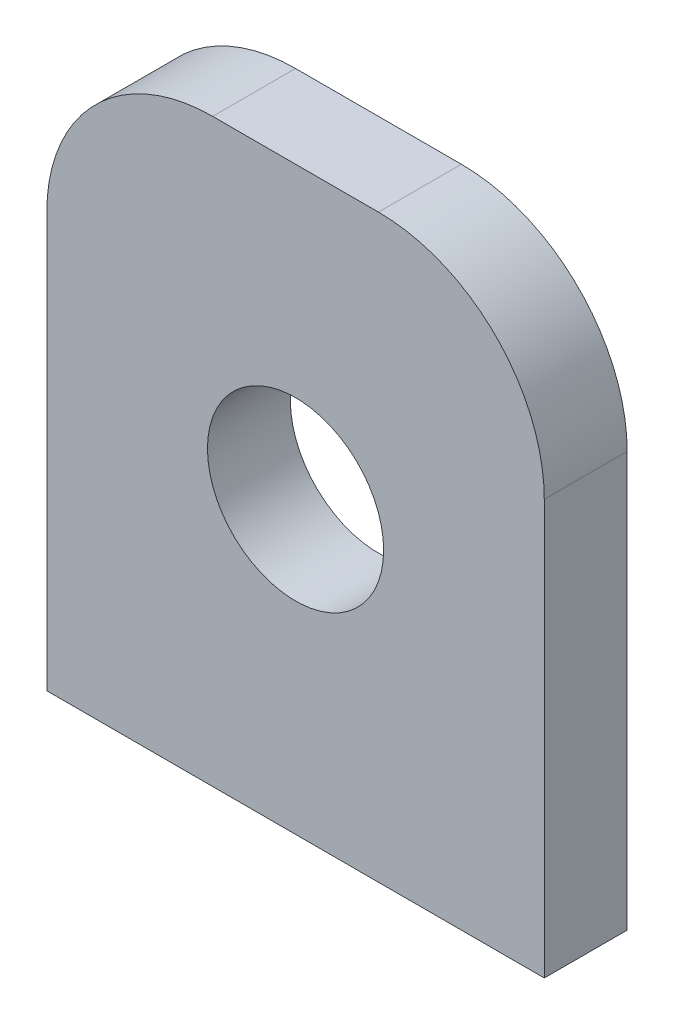
ISO-10303-21;
HEADER;
FILE_DESCRIPTION(('STEP AP214'),'2;1');
FILE_NAME('part.step','',(''),(''),'','','');
FILE_SCHEMA(('AUTOMOTIVE_DESIGN { 1 0 10303 214 1 1 1 1 }'));
ENDSEC;
DATA;
#1=APPLICATION_CONTEXT('core data for automotive mechanical design processes');
#2=APPLICATION_PROTOCOL_DEFINITION('international standard','automotive_design',2000,#1);
#3=PRODUCT_CONTEXT('',#1,'mechanical');
#4=PRODUCT('Part','Part','',(#3));
#5=PRODUCT_RELATED_PRODUCT_CATEGORY('part','',(#4));
#6=PRODUCT_DEFINITION_FORMATION('','',#4);
#7=PRODUCT_DEFINITION_CONTEXT('part definition',#1,'design');
#8=PRODUCT_DEFINITION('design','',#6,#7);
#9=PRODUCT_DEFINITION_SHAPE('','',#8);
#10=(LENGTH_UNIT() NAMED_UNIT(*) SI_UNIT(.MILLI.,.METRE.));
#11=(NAMED_UNIT(*) PLANE_ANGLE_UNIT() SI_UNIT($,.RADIAN.));
#12=(NAMED_UNIT(*) SI_UNIT($,.STERADIAN.) SOLID_ANGLE_UNIT());
#13=UNCERTAINTY_MEASURE_WITH_UNIT(LENGTH_MEASURE(1.E-05),#10,'distance_accuracy_value','');
#14=(GEOMETRIC_REPRESENTATION_CONTEXT(3) GLOBAL_UNCERTAINTY_ASSIGNED_CONTEXT((#13)) GLOBAL_UNIT_ASSIGNED_CONTEXT((#10,
#11,#12)) REPRESENTATION_CONTEXT('',''));
#15=CARTESIAN_POINT('',(0.,0.,0.));
#16=DIRECTION('',(0.,0.,1.));
#17=DIRECTION('',(1.,0.,0.));
#18=AXIS2_PLACEMENT_3D('',#15,#16,#17);
#19=CARTESIAN_POINT('',(12.7,19.05,6.35));
#20=DIRECTION('',(0.,0.,1.));
#21=DIRECTION('',(1.,0.,0.));
#22=AXIS2_PLACEMENT_3D('',#19,#20,#21);
#23=PLANE('',#22);
#24=DIRECTION('',(0.,1.,0.));
#25=VECTOR('',#24,1.);
#26=CARTESIAN_POINT('',(38.1,-44.45,6.35));
#27=LINE('',#26,#25);
#28=CARTESIAN_POINT('',(38.1,-44.45,6.35));
#29=VERTEX_POINT('',#28);
#30=CARTESIAN_POINT('',(38.1,19.05,6.35));
#31=VERTEX_POINT('',#30);
#32=EDGE_CURVE('E138',#29,#31,#27,.T.);
#33=ORIENTED_EDGE('',*,*,#32,.T.);
#34=CARTESIAN_POINT('',(12.7,19.05,6.35));
#35=DIRECTION('',(0.,0.,1.));
#36=DIRECTION('',(1.,0.,0.));
#37=AXIS2_PLACEMENT_3D('',#34,#35,#36);
#38=CIRCLE('',#37,25.4);
#39=CARTESIAN_POINT('',(12.7,44.45,6.35));
#40=VERTEX_POINT('',#39);
#41=EDGE_CURVE('E94',#31,#40,#38,.T.);
#42=ORIENTED_EDGE('',*,*,#41,.T.);
#43=DIRECTION('',(-1.,0.,0.));
#44=VECTOR('',#43,1.);
#45=CARTESIAN_POINT('',(12.7,44.45,6.35));
#46=LINE('',#45,#44);
#47=CARTESIAN_POINT('',(-12.7,44.45,6.35));
#48=VERTEX_POINT('',#47);
#49=EDGE_CURVE('E109',#40,#48,#46,.T.);
#50=ORIENTED_EDGE('',*,*,#49,.T.);
#51=CARTESIAN_POINT('',(-12.7,19.05,6.35));
#52=DIRECTION('',(0.,0.,1.));
#53=DIRECTION('',(1.,0.,0.));
#54=AXIS2_PLACEMENT_3D('',#51,#52,#53);
#55=CIRCLE('',#54,25.4);
#56=CARTESIAN_POINT('',(-38.1,19.05,6.35));
#57=VERTEX_POINT('',#56);
#58=EDGE_CURVE('E103',#48,#57,#55,.T.);
#59=ORIENTED_EDGE('',*,*,#58,.T.);
#60=DIRECTION('',(0.,-1.,0.));
#61=VECTOR('',#60,1.);
#62=CARTESIAN_POINT('',(-38.1,-44.45,6.35));
#63=LINE('',#62,#61);
#64=CARTESIAN_POINT('',(-38.1,-44.45,6.35));
#65=VERTEX_POINT('',#64);
#66=EDGE_CURVE('E107',#57,#65,#63,.T.);
#67=ORIENTED_EDGE('',*,*,#66,.T.);
#68=DIRECTION('',(1.,0.,0.));
#69=VECTOR('',#68,1.);
#70=CARTESIAN_POINT('',(38.1,-44.45,6.35));
#71=LINE('',#70,#69);
#72=EDGE_CURVE('E56',#65,#29,#71,.T.);
#73=ORIENTED_EDGE('',*,*,#72,.T.);
#74=EDGE_LOOP('',(#33,#42,#50,#59,#67,#73));
#75=FACE_BOUND('',#74,.T.);
#76=CARTESIAN_POINT('',(0.,0.,6.35));
#77=DIRECTION('',(0.,0.,1.));
#78=DIRECTION('',(1.,0.,0.));
#79=AXIS2_PLACEMENT_3D('',#76,#77,#78);
#80=CIRCLE('',#79,13.49375);
#81=CARTESIAN_POINT('',(13.49375,0.,6.35));
#82=VERTEX_POINT('',#81);
#83=EDGE_CURVE('E131',#82,#82,#80,.T.);
#84=ORIENTED_EDGE('',*,*,#83,.F.);
#85=EDGE_LOOP('',(#84));
#86=FACE_BOUND('',#85,.T.);
#87=ADVANCED_FACE('F39',(#75,#86),#23,.T.);
#88=CARTESIAN_POINT('',(12.7,19.05,-6.35));
#89=DIRECTION('',(0.,0.,1.));
#90=DIRECTION('',(1.,0.,0.));
#91=AXIS2_PLACEMENT_3D('',#88,#89,#90);
#92=PLANE('',#91);
#93=DIRECTION('',(0.,1.,0.));
#94=VECTOR('',#93,1.);
#95=CARTESIAN_POINT('',(38.1,-44.45,-6.35));
#96=LINE('',#95,#94);
#97=CARTESIAN_POINT('',(38.1,-44.45,-6.35));
#98=VERTEX_POINT('',#97);
#99=CARTESIAN_POINT('',(38.1,19.05,-6.35));
#100=VERTEX_POINT('',#99);
#101=EDGE_CURVE('E127',#98,#100,#96,.T.);
#102=ORIENTED_EDGE('',*,*,#101,.F.);
#103=DIRECTION('',(1.,0.,0.));
#104=VECTOR('',#103,1.);
#105=CARTESIAN_POINT('',(38.1,-44.45,-6.35));
#106=LINE('',#105,#104);
#107=CARTESIAN_POINT('',(-38.1,-44.45,-6.35));
#108=VERTEX_POINT('',#107);
#109=EDGE_CURVE('E86',#108,#98,#106,.T.);
#110=ORIENTED_EDGE('',*,*,#109,.F.);
#111=DIRECTION('',(0.,-1.,0.));
#112=VECTOR('',#111,1.);
#113=CARTESIAN_POINT('',(-38.1,-44.45,-6.35));
#114=LINE('',#113,#112);
#115=CARTESIAN_POINT('',(-38.1,19.05,-6.35));
#116=VERTEX_POINT('',#115);
#117=EDGE_CURVE('E80',#116,#108,#114,.T.);
#118=ORIENTED_EDGE('',*,*,#117,.F.);
#119=CARTESIAN_POINT('',(-12.7,19.05,-6.35));
#120=DIRECTION('',(0.,0.,1.));
#121=DIRECTION('',(1.,0.,0.));
#122=AXIS2_PLACEMENT_3D('',#119,#120,#121);
#123=CIRCLE('',#122,25.4);
#124=CARTESIAN_POINT('',(-12.7,44.45,-6.35));
#125=VERTEX_POINT('',#124);
#126=EDGE_CURVE('E117',#125,#116,#123,.T.);
#127=ORIENTED_EDGE('',*,*,#126,.F.);
#128=DIRECTION('',(-1.,0.,0.));
#129=VECTOR('',#128,1.);
#130=CARTESIAN_POINT('',(12.7,44.45,-6.35));
#131=LINE('',#130,#129);
#132=CARTESIAN_POINT('',(12.7,44.45,-6.35));
#133=VERTEX_POINT('',#132);
#134=EDGE_CURVE('E133',#133,#125,#131,.T.);
#135=ORIENTED_EDGE('',*,*,#134,.F.);
#136=CARTESIAN_POINT('',(12.7,19.05,-6.35));
#137=DIRECTION('',(0.,0.,1.));
#138=DIRECTION('',(1.,0.,0.));
#139=AXIS2_PLACEMENT_3D('',#136,#137,#138);
#140=CIRCLE('',#139,25.4);
#141=EDGE_CURVE('E130',#100,#133,#140,.T.);
#142=ORIENTED_EDGE('',*,*,#141,.F.);
#143=EDGE_LOOP('',(#102,#110,#118,#127,#135,#142));
#144=FACE_BOUND('',#143,.T.);
#145=CARTESIAN_POINT('',(0.,0.,-6.35));
#146=DIRECTION('',(0.,0.,1.));
#147=DIRECTION('',(1.,0.,0.));
#148=AXIS2_PLACEMENT_3D('',#145,#146,#147);
#149=CIRCLE('',#148,13.49375);
#150=CARTESIAN_POINT('',(13.49375,0.,-6.35));
#151=VERTEX_POINT('',#150);
#152=EDGE_CURVE('E205',#151,#151,#149,.T.);
#153=ORIENTED_EDGE('',*,*,#152,.T.);
#154=EDGE_LOOP('',(#153));
#155=FACE_BOUND('',#154,.T.);
#156=ADVANCED_FACE('F147',(#144,#155),#92,.F.);
#157=CARTESIAN_POINT('',(38.1,-44.45,6.35));
#158=DIRECTION('',(-1.,0.,0.));
#159=DIRECTION('',(0.,0.,1.));
#160=AXIS2_PLACEMENT_3D('',#157,#158,#159);
#161=PLANE('',#160);
#162=ORIENTED_EDGE('',*,*,#101,.T.);
#163=DIRECTION('',(0.,0.,-1.));
#164=VECTOR('',#163,1.);
#165=CARTESIAN_POINT('',(38.1,19.05,6.35));
#166=LINE('',#165,#164);
#167=EDGE_CURVE('E11',#31,#100,#166,.T.);
#168=ORIENTED_EDGE('',*,*,#167,.F.);
#169=ORIENTED_EDGE('',*,*,#32,.F.);
#170=DIRECTION('',(0.,0.,-1.));
#171=VECTOR('',#170,1.);
#172=CARTESIAN_POINT('',(38.1,-44.45,6.35));
#173=LINE('',#172,#171);
#174=EDGE_CURVE('E123',#29,#98,#173,.T.);
#175=ORIENTED_EDGE('',*,*,#174,.T.);
#176=EDGE_LOOP('',(#162,#168,#169,#175));
#177=FACE_BOUND('',#176,.T.);
#178=ADVANCED_FACE('F41',(#177),#161,.F.);
#179=CARTESIAN_POINT('',(12.7,19.05,6.35));
#180=DIRECTION('',(0.,0.,-1.));
#181=DIRECTION('',(-1.,0.,0.));
#182=AXIS2_PLACEMENT_3D('',#179,#180,#181);
#183=CYLINDRICAL_SURFACE('',#182,25.4);
#184=ORIENTED_EDGE('',*,*,#141,.T.);
#185=DIRECTION('',(0.,0.,-1.));
#186=VECTOR('',#185,1.);
#187=CARTESIAN_POINT('',(12.7,44.45,6.35));
#188=LINE('',#187,#186);
#189=EDGE_CURVE('E48',#40,#133,#188,.T.);
#190=ORIENTED_EDGE('',*,*,#189,.F.);
#191=ORIENTED_EDGE('',*,*,#41,.F.);
#192=ORIENTED_EDGE('',*,*,#167,.T.);
#193=EDGE_LOOP('',(#184,#190,#191,#192));
#194=FACE_BOUND('',#193,.T.);
#195=ADVANCED_FACE('F263',(#194),#183,.T.);
#196=CARTESIAN_POINT('',(12.7,44.45,6.35));
#197=DIRECTION('',(0.,-1.,0.));
#198=DIRECTION('',(0.,0.,-1.));
#199=AXIS2_PLACEMENT_3D('',#196,#197,#198);
#200=PLANE('',#199);
#201=ORIENTED_EDGE('',*,*,#134,.T.);
#202=DIRECTION('',(0.,0.,-1.));
#203=VECTOR('',#202,1.);
#204=CARTESIAN_POINT('',(-12.7,44.45,6.35));
#205=LINE('',#204,#203);
#206=EDGE_CURVE('E118',#48,#125,#205,.T.);
#207=ORIENTED_EDGE('',*,*,#206,.F.);
#208=ORIENTED_EDGE('',*,*,#49,.F.);
#209=ORIENTED_EDGE('',*,*,#189,.T.);
#210=EDGE_LOOP('',(#201,#207,#208,#209));
#211=FACE_BOUND('',#210,.T.);
#212=ADVANCED_FACE('F144',(#211),#200,.F.);
#213=CARTESIAN_POINT('',(-12.7,19.05,6.35));
#214=DIRECTION('',(0.,0.,-1.));
#215=DIRECTION('',(-1.,0.,0.));
#216=AXIS2_PLACEMENT_3D('',#213,#214,#215);
#217=CYLINDRICAL_SURFACE('',#216,25.4);
#218=ORIENTED_EDGE('',*,*,#126,.T.);
#219=DIRECTION('',(0.,0.,-1.));
#220=VECTOR('',#219,1.);
#221=CARTESIAN_POINT('',(-38.1,19.05,6.35));
#222=LINE('',#221,#220);
#223=EDGE_CURVE('E114',#57,#116,#222,.T.);
#224=ORIENTED_EDGE('',*,*,#223,.F.);
#225=ORIENTED_EDGE('',*,*,#58,.F.);
#226=ORIENTED_EDGE('',*,*,#206,.T.);
#227=EDGE_LOOP('',(#218,#224,#225,#226));
#228=FACE_BOUND('',#227,.T.);
#229=ADVANCED_FACE('F115',(#228),#217,.T.);
#230=CARTESIAN_POINT('',(-38.1,-44.45,6.35));
#231=DIRECTION('',(1.,0.,0.));
#232=DIRECTION('',(0.,0.,-1.));
#233=AXIS2_PLACEMENT_3D('',#230,#231,#232);
#234=PLANE('',#233);
#235=ORIENTED_EDGE('',*,*,#117,.T.);
#236=DIRECTION('',(0.,0.,-1.));
#237=VECTOR('',#236,1.);
#238=CARTESIAN_POINT('',(-38.1,-44.45,6.35));
#239=LINE('',#238,#237);
#240=EDGE_CURVE('E119',#65,#108,#239,.T.);
#241=ORIENTED_EDGE('',*,*,#240,.F.);
#242=ORIENTED_EDGE('',*,*,#66,.F.);
#243=ORIENTED_EDGE('',*,*,#223,.T.);
#244=EDGE_LOOP('',(#235,#241,#242,#243));
#245=FACE_BOUND('',#244,.T.);
#246=ADVANCED_FACE('F121',(#245),#234,.F.);
#247=CARTESIAN_POINT('',(38.1,-44.45,6.35));
#248=DIRECTION('',(0.,1.,0.));
#249=DIRECTION('',(-1.,0.,0.));
#250=AXIS2_PLACEMENT_3D('',#247,#248,#249);
#251=PLANE('',#250);
#252=CARTESIAN_POINT('',(-19.05,-44.45,0.));
#253=DIRECTION('',(0.,-1.,0.));
#254=DIRECTION('',(0.,0.,-1.));
#255=AXIS2_PLACEMENT_3D('',#252,#253,#254);
#256=CIRCLE('',#255,2.0193);
#257=CARTESIAN_POINT('',(-19.05,-44.45,-2.0193));
#258=VERTEX_POINT('',#257);
#259=EDGE_CURVE('E195',#258,#258,#256,.T.);
#260=ORIENTED_EDGE('',*,*,#259,.F.);
#261=EDGE_LOOP('',(#260));
#262=FACE_BOUND('',#261,.T.);
#263=CARTESIAN_POINT('',(19.05,-44.45,0.));
#264=DIRECTION('',(0.,-1.,0.));
#265=DIRECTION('',(0.,0.,-1.));
#266=AXIS2_PLACEMENT_3D('',#263,#264,#265);
#267=CIRCLE('',#266,2.0193);
#268=CARTESIAN_POINT('',(19.05,-44.45,-2.0193));
#269=VERTEX_POINT('',#268);
#270=EDGE_CURVE('E197',#269,#269,#267,.T.);
#271=ORIENTED_EDGE('',*,*,#270,.F.);
#272=EDGE_LOOP('',(#271));
#273=FACE_BOUND('',#272,.T.);
#274=ORIENTED_EDGE('',*,*,#109,.T.);
#275=ORIENTED_EDGE('',*,*,#174,.F.);
#276=ORIENTED_EDGE('',*,*,#72,.F.);
#277=ORIENTED_EDGE('',*,*,#240,.T.);
#278=EDGE_LOOP('',(#274,#275,#276,#277));
#279=FACE_BOUND('',#278,.T.);
#280=ADVANCED_FACE('F152',(#262,#273,#279),#251,.F.);
#281=CARTESIAN_POINT('',(0.,0.,6.35));
#282=DIRECTION('',(0.,0.,-1.));
#283=DIRECTION('',(-1.,0.,0.));
#284=AXIS2_PLACEMENT_3D('',#281,#282,#283);
#285=CYLINDRICAL_SURFACE('',#284,13.49375);
#286=ORIENTED_EDGE('',*,*,#83,.T.);
#287=EDGE_LOOP('',(#286));
#288=FACE_BOUND('',#287,.T.);
#289=ORIENTED_EDGE('',*,*,#152,.F.);
#290=EDGE_LOOP('',(#289));
#291=FACE_BOUND('',#290,.T.);
#292=ADVANCED_FACE('F154',(#288,#291),#285,.F.);
#293=CARTESIAN_POINT('',(19.05,-32.42056,0.));
#294=DIRECTION('',(0.,-1.,0.));
#295=DIRECTION('',(0.,0.,-1.));
#296=AXIS2_PLACEMENT_3D('',#293,#294,#295);
#297=CONICAL_SURFACE('',#296,2.0193,1.02974425867665);
#298=CARTESIAN_POINT('',(19.05,-31.2072421519976,0.));
#299=VERTEX_POINT('',#298);
#300=VERTEX_LOOP('',#299);
#301=FACE_BOUND('',#300,.T.);
#302=CARTESIAN_POINT('',(19.05,-32.42056,0.));
#303=DIRECTION('',(0.,-1.,0.));
#304=DIRECTION('',(0.,0.,-1.));
#305=AXIS2_PLACEMENT_3D('',#302,#303,#304);
#306=CIRCLE('',#305,2.0193);
#307=CARTESIAN_POINT('',(19.05,-32.42056,-2.0193));
#308=VERTEX_POINT('',#307);
#309=EDGE_CURVE('E202',#308,#308,#306,.T.);
#310=ORIENTED_EDGE('',*,*,#309,.T.);
#311=EDGE_LOOP('',(#310));
#312=FACE_BOUND('',#311,.T.);
#313=ADVANCED_FACE('F161',(#301,#312),#297,.F.);
#314=CARTESIAN_POINT('',(19.05,-44.45,0.));
#315=DIRECTION('',(0.,-1.,0.));
#316=DIRECTION('',(0.,0.,-1.));
#317=AXIS2_PLACEMENT_3D('',#314,#315,#316);
#318=CYLINDRICAL_SURFACE('',#317,2.0193);
#319=ORIENTED_EDGE('',*,*,#309,.F.);
#320=EDGE_LOOP('',(#319));
#321=FACE_BOUND('',#320,.T.);
#322=ORIENTED_EDGE('',*,*,#270,.T.);
#323=EDGE_LOOP('',(#322));
#324=FACE_BOUND('',#323,.T.);
#325=ADVANCED_FACE('F176',(#321,#324),#318,.F.);
#326=CARTESIAN_POINT('',(-19.05,-32.42056,0.));
#327=DIRECTION('',(0.,-1.,0.));
#328=DIRECTION('',(0.,0.,-1.));
#329=AXIS2_PLACEMENT_3D('',#326,#327,#328);
#330=CONICAL_SURFACE('',#329,2.0193,1.02974425867665);
#331=CARTESIAN_POINT('',(-19.05,-31.2072421519976,0.));
#332=VERTEX_POINT('',#331);
#333=VERTEX_LOOP('',#332);
#334=FACE_BOUND('',#333,.T.);
#335=CARTESIAN_POINT('',(-19.05,-32.42056,0.));
#336=DIRECTION('',(0.,-1.,0.));
#337=DIRECTION('',(0.,0.,-1.));
#338=AXIS2_PLACEMENT_3D('',#335,#336,#337);
#339=CIRCLE('',#338,2.0193);
#340=CARTESIAN_POINT('',(-19.05,-32.42056,-2.0193));
#341=VERTEX_POINT('',#340);
#342=EDGE_CURVE('E193',#341,#341,#339,.T.);
#343=ORIENTED_EDGE('',*,*,#342,.T.);
#344=EDGE_LOOP('',(#343));
#345=FACE_BOUND('',#344,.T.);
#346=ADVANCED_FACE('F180',(#334,#345),#330,.F.);
#347=CARTESIAN_POINT('',(-19.05,-44.45,0.));
#348=DIRECTION('',(0.,-1.,0.));
#349=DIRECTION('',(0.,0.,-1.));
#350=AXIS2_PLACEMENT_3D('',#347,#348,#349);
#351=CYLINDRICAL_SURFACE('',#350,2.0193);
#352=ORIENTED_EDGE('',*,*,#342,.F.);
#353=EDGE_LOOP('',(#352));
#354=FACE_BOUND('',#353,.T.);
#355=ORIENTED_EDGE('',*,*,#259,.T.);
#356=EDGE_LOOP('',(#355));
#357=FACE_BOUND('',#356,.T.);
#358=ADVANCED_FACE('F184',(#354,#357),#351,.F.);
#359=CLOSED_SHELL('',(#87,#156,#178,#195,#212,#229,#246,#280,#292,#313,#325,#346,#358));
#360=MANIFOLD_SOLID_BREP('B2',#359);
#361=ADVANCED_BREP_SHAPE_REPRESENTATION('',(#18,#360),#14);
#362=SHAPE_DEFINITION_REPRESENTATION(#9,#361);
ENDSEC;
END-ISO-10303-21;
